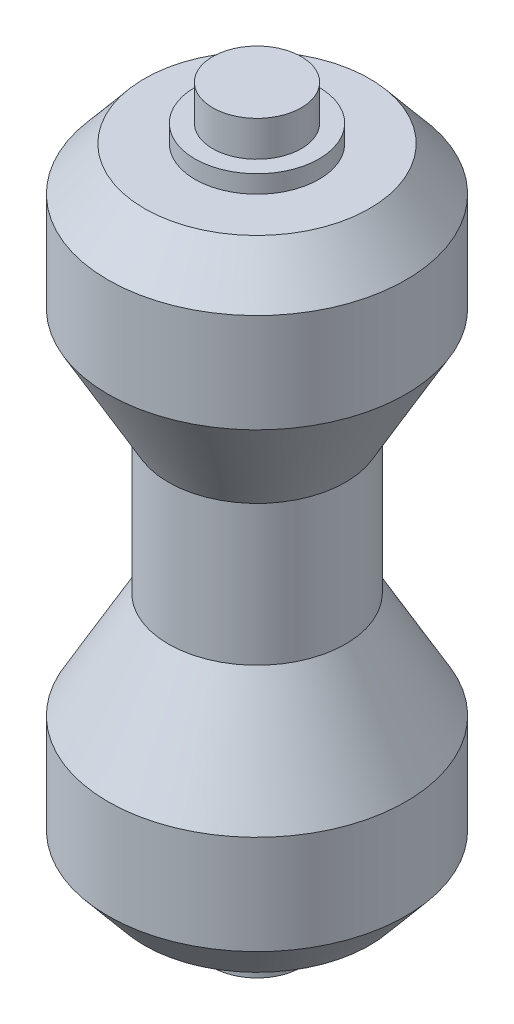
ISO-10303-21;
HEADER;
FILE_DESCRIPTION(('STEP AP214'),'2;1');
FILE_NAME('part.step','',(''),(''),'','','');
FILE_SCHEMA(('AUTOMOTIVE_DESIGN { 1 0 10303 214 1 1 1 1 }'));
ENDSEC;
DATA;
#1=APPLICATION_CONTEXT('core data for automotive mechanical design processes');
#2=APPLICATION_PROTOCOL_DEFINITION('international standard','automotive_design',2000,#1);
#3=PRODUCT_CONTEXT('',#1,'mechanical');
#4=PRODUCT('Part','Part','',(#3));
#5=PRODUCT_RELATED_PRODUCT_CATEGORY('part','',(#4));
#6=PRODUCT_DEFINITION_FORMATION('','',#4);
#7=PRODUCT_DEFINITION_CONTEXT('part definition',#1,'design');
#8=PRODUCT_DEFINITION('design','',#6,#7);
#9=PRODUCT_DEFINITION_SHAPE('','',#8);
#10=(LENGTH_UNIT() NAMED_UNIT(*) SI_UNIT(.MILLI.,.METRE.));
#11=(NAMED_UNIT(*) PLANE_ANGLE_UNIT() SI_UNIT($,.RADIAN.));
#12=(NAMED_UNIT(*) SI_UNIT($,.STERADIAN.) SOLID_ANGLE_UNIT());
#13=UNCERTAINTY_MEASURE_WITH_UNIT(LENGTH_MEASURE(1.E-05),#10,'distance_accuracy_value','');
#14=(GEOMETRIC_REPRESENTATION_CONTEXT(3) GLOBAL_UNCERTAINTY_ASSIGNED_CONTEXT((#13)) GLOBAL_UNIT_ASSIGNED_CONTEXT((#10,
#11,#12)) REPRESENTATION_CONTEXT('',''));
#15=CARTESIAN_POINT('',(0.,0.,0.));
#16=DIRECTION('',(0.,0.,1.));
#17=DIRECTION('',(1.,0.,0.));
#18=AXIS2_PLACEMENT_3D('',#15,#16,#17);
#19=CARTESIAN_POINT('',(0.,34.5729996705078,0.));
#20=DIRECTION('',(0.,-1.,0.));
#21=DIRECTION('',(0.,0.,-1.));
#22=AXIS2_PLACEMENT_3D('',#19,#20,#21);
#23=PLANE('',#22);
#24=CARTESIAN_POINT('',(0.,34.5729996705078,0.));
#25=DIRECTION('',(0.,1.,0.));
#26=DIRECTION('',(0.,0.,1.));
#27=AXIS2_PLACEMENT_3D('',#24,#25,#26);
#28=CIRCLE('',#27,2.5);
#29=CARTESIAN_POINT('',(0.,34.5729996705078,2.5));
#30=VERTEX_POINT('',#29);
#31=EDGE_CURVE('E10',#30,#30,#28,.T.);
#32=ORIENTED_EDGE('',*,*,#31,.T.);
#33=EDGE_LOOP('',(#32));
#34=FACE_BOUND('',#33,.T.);
#35=ADVANCED_FACE('F31',(#34),#23,.F.);
#36=CARTESIAN_POINT('',(0.,34.5729996705078,0.));
#37=DIRECTION('',(0.,1.,0.));
#38=DIRECTION('',(0.,0.,1.));
#39=AXIS2_PLACEMENT_3D('',#36,#37,#38);
#40=CYLINDRICAL_SURFACE('',#39,2.5);
#41=ORIENTED_EDGE('',*,*,#31,.F.);
#42=EDGE_LOOP('',(#41));
#43=FACE_BOUND('',#42,.T.);
#44=CARTESIAN_POINT('',(0.,32.5729996705078,0.));
#45=DIRECTION('',(0.,1.,0.));
#46=DIRECTION('',(0.,0.,1.));
#47=AXIS2_PLACEMENT_3D('',#44,#45,#46);
#48=CIRCLE('',#47,2.5);
#49=CARTESIAN_POINT('',(0.,32.5729996705078,2.5));
#50=VERTEX_POINT('',#49);
#51=EDGE_CURVE('E37',#50,#50,#48,.T.);
#52=ORIENTED_EDGE('',*,*,#51,.T.);
#53=EDGE_LOOP('',(#52));
#54=FACE_BOUND('',#53,.T.);
#55=ADVANCED_FACE('F101',(#43,#54),#40,.T.);
#56=CARTESIAN_POINT('',(2.5,32.5729996705078,0.));
#57=DIRECTION('',(0.,-1.,0.));
#58=DIRECTION('',(0.,0.,-1.));
#59=AXIS2_PLACEMENT_3D('',#56,#57,#58);
#60=PLANE('',#59);
#61=ORIENTED_EDGE('',*,*,#51,.F.);
#62=EDGE_LOOP('',(#61));
#63=FACE_BOUND('',#62,.T.);
#64=CARTESIAN_POINT('',(0.,32.5729996705078,0.));
#65=DIRECTION('',(0.,1.,0.));
#66=DIRECTION('',(0.,0.,1.));
#67=AXIS2_PLACEMENT_3D('',#64,#65,#66);
#68=CIRCLE('',#67,3.5);
#69=CARTESIAN_POINT('',(0.,32.5729996705078,3.5));
#70=VERTEX_POINT('',#69);
#71=EDGE_CURVE('E41',#70,#70,#68,.T.);
#72=ORIENTED_EDGE('',*,*,#71,.T.);
#73=EDGE_LOOP('',(#72));
#74=FACE_BOUND('',#73,.T.);
#75=ADVANCED_FACE('F105',(#63,#74),#60,.F.);
#76=CARTESIAN_POINT('',(0.,34.5729996705078,0.));
#77=DIRECTION('',(0.,1.,0.));
#78=DIRECTION('',(0.,0.,1.));
#79=AXIS2_PLACEMENT_3D('',#76,#77,#78);
#80=CYLINDRICAL_SURFACE('',#79,3.5);
#81=ORIENTED_EDGE('',*,*,#71,.F.);
#82=EDGE_LOOP('',(#81));
#83=FACE_BOUND('',#82,.T.);
#84=CARTESIAN_POINT('',(0.,31.5729996705078,0.));
#85=DIRECTION('',(0.,1.,0.));
#86=DIRECTION('',(0.,0.,1.));
#87=AXIS2_PLACEMENT_3D('',#84,#85,#86);
#88=CIRCLE('',#87,3.5);
#89=CARTESIAN_POINT('',(0.,31.5729996705078,3.5));
#90=VERTEX_POINT('',#89);
#91=EDGE_CURVE('E45',#90,#90,#88,.T.);
#92=ORIENTED_EDGE('',*,*,#91,.T.);
#93=EDGE_LOOP('',(#92));
#94=FACE_BOUND('',#93,.T.);
#95=ADVANCED_FACE('F110',(#83,#94),#80,.T.);
#96=CARTESIAN_POINT('',(3.5,31.5729996705078,0.));
#97=DIRECTION('',(0.,-1.,0.));
#98=DIRECTION('',(0.,0.,-1.));
#99=AXIS2_PLACEMENT_3D('',#96,#97,#98);
#100=PLANE('',#99);
#101=ORIENTED_EDGE('',*,*,#91,.F.);
#102=EDGE_LOOP('',(#101));
#103=FACE_BOUND('',#102,.T.);
#104=CARTESIAN_POINT('',(0.,31.5729996705078,0.));
#105=DIRECTION('',(0.,1.,0.));
#106=DIRECTION('',(0.,0.,1.));
#107=AXIS2_PLACEMENT_3D('',#104,#105,#106);
#108=CIRCLE('',#107,6.35094369584215);
#109=CARTESIAN_POINT('',(0.,31.5729996705078,6.35094369584215));
#110=VERTEX_POINT('',#109);
#111=EDGE_CURVE('E50',#110,#110,#108,.T.);
#112=ORIENTED_EDGE('',*,*,#111,.T.);
#113=EDGE_LOOP('',(#112));
#114=FACE_BOUND('',#113,.T.);
#115=ADVANCED_FACE('F116',(#103,#114),#100,.F.);
#116=CARTESIAN_POINT('',(0.,29.111258282024,0.));
#117=DIRECTION('',(0.,-1.,0.));
#118=DIRECTION('',(0.,0.,-1.));
#119=AXIS2_PLACEMENT_3D('',#116,#117,#118);
#120=CONICAL_SURFACE('',#119,8.40239485291198,0.694738276196704);
#121=ORIENTED_EDGE('',*,*,#111,.F.);
#122=EDGE_LOOP('',(#121));
#123=FACE_BOUND('',#122,.T.);
#124=CARTESIAN_POINT('',(0.,29.111258282024,0.));
#125=DIRECTION('',(0.,1.,0.));
#126=DIRECTION('',(0.,0.,1.));
#127=AXIS2_PLACEMENT_3D('',#124,#125,#126);
#128=CIRCLE('',#127,8.40239485291198);
#129=CARTESIAN_POINT('',(0.,29.111258282024,8.40239485291198));
#130=VERTEX_POINT('',#129);
#131=EDGE_CURVE('E53',#130,#130,#128,.T.);
#132=ORIENTED_EDGE('',*,*,#131,.T.);
#133=EDGE_LOOP('',(#132));
#134=FACE_BOUND('',#133,.T.);
#135=ADVANCED_FACE('F120',(#123,#134),#120,.T.);
#136=CARTESIAN_POINT('',(0.,34.5729996705078,0.));
#137=DIRECTION('',(0.,1.,0.));
#138=DIRECTION('',(0.,0.,1.));
#139=AXIS2_PLACEMENT_3D('',#136,#137,#138);
#140=CYLINDRICAL_SURFACE('',#139,8.40239485291198);
#141=ORIENTED_EDGE('',*,*,#131,.F.);
#142=EDGE_LOOP('',(#141));
#143=FACE_BOUND('',#142,.T.);
#144=CARTESIAN_POINT('',(0.,23.525945839723,0.));
#145=DIRECTION('',(0.,1.,0.));
#146=DIRECTION('',(0.,0.,1.));
#147=AXIS2_PLACEMENT_3D('',#144,#145,#146);
#148=CIRCLE('',#147,8.40239485291198);
#149=CARTESIAN_POINT('',(0.,23.525945839723,8.40239485291198));
#150=VERTEX_POINT('',#149);
#151=EDGE_CURVE('E56',#150,#150,#148,.T.);
#152=ORIENTED_EDGE('',*,*,#151,.T.);
#153=EDGE_LOOP('',(#152));
#154=FACE_BOUND('',#153,.T.);
#155=ADVANCED_FACE('F124',(#143,#154),#140,.T.);
#156=CARTESIAN_POINT('',(0.,17.525945839723,0.));
#157=DIRECTION('',(0.,1.,0.));
#158=DIRECTION('',(0.,0.,1.));
#159=AXIS2_PLACEMENT_3D('',#156,#157,#158);
#160=CONICAL_SURFACE('',#159,5.,0.515851081836486);
#161=ORIENTED_EDGE('',*,*,#151,.F.);
#162=EDGE_LOOP('',(#161));
#163=FACE_BOUND('',#162,.T.);
#164=CARTESIAN_POINT('',(0.,17.525945839723,0.));
#165=DIRECTION('',(0.,1.,0.));
#166=DIRECTION('',(0.,0.,1.));
#167=AXIS2_PLACEMENT_3D('',#164,#165,#166);
#168=CIRCLE('',#167,5.);
#169=CARTESIAN_POINT('',(0.,17.525945839723,5.));
#170=VERTEX_POINT('',#169);
#171=EDGE_CURVE('E59',#170,#170,#168,.T.);
#172=ORIENTED_EDGE('',*,*,#171,.T.);
#173=EDGE_LOOP('',(#172));
#174=FACE_BOUND('',#173,.T.);
#175=ADVANCED_FACE('F128',(#163,#174),#160,.T.);
#176=CARTESIAN_POINT('',(0.,34.5729996705078,0.));
#177=DIRECTION('',(0.,1.,0.));
#178=DIRECTION('',(0.,0.,1.));
#179=AXIS2_PLACEMENT_3D('',#176,#177,#178);
#180=CYLINDRICAL_SURFACE('',#179,5.);
#181=ORIENTED_EDGE('',*,*,#171,.F.);
#182=EDGE_LOOP('',(#181));
#183=FACE_BOUND('',#182,.T.);
#184=CARTESIAN_POINT('',(0.,9.62005350129262,0.));
#185=DIRECTION('',(0.,1.,0.));
#186=DIRECTION('',(0.,0.,1.));
#187=AXIS2_PLACEMENT_3D('',#184,#185,#186);
#188=CIRCLE('',#187,5.);
#189=CARTESIAN_POINT('',(0.,9.62005350129262,5.));
#190=VERTEX_POINT('',#189);
#191=EDGE_CURVE('E83',#190,#190,#188,.T.);
#192=ORIENTED_EDGE('',*,*,#191,.T.);
#193=EDGE_LOOP('',(#192));
#194=FACE_BOUND('',#193,.T.);
#195=ADVANCED_FACE('F87',(#183,#194),#180,.T.);
#196=CARTESIAN_POINT('',(0.,-7.42700032949218,0.));
#197=DIRECTION('',(0.,1.,0.));
#198=DIRECTION('',(0.,0.,-1.));
#199=AXIS2_PLACEMENT_3D('',#196,#197,#198);
#200=PLANE('',#199);
#201=CARTESIAN_POINT('',(0.,-7.42700032949218,0.));
#202=DIRECTION('',(0.,1.,0.));
#203=DIRECTION('',(0.,0.,1.));
#204=AXIS2_PLACEMENT_3D('',#201,#202,#203);
#205=CIRCLE('',#204,2.5);
#206=CARTESIAN_POINT('',(0.,-7.42700032949218,2.5));
#207=VERTEX_POINT('',#206);
#208=EDGE_CURVE('E62',#207,#207,#205,.T.);
#209=ORIENTED_EDGE('',*,*,#208,.F.);
#210=EDGE_LOOP('',(#209));
#211=FACE_BOUND('',#210,.T.);
#212=ADVANCED_FACE('F135',(#211),#200,.F.);
#213=CARTESIAN_POINT('',(0.,-7.42700032949218,0.));
#214=DIRECTION('',(0.,-1.,0.));
#215=DIRECTION('',(0.,0.,1.));
#216=AXIS2_PLACEMENT_3D('',#213,#214,#215);
#217=CYLINDRICAL_SURFACE('',#216,2.5);
#218=ORIENTED_EDGE('',*,*,#208,.T.);
#219=EDGE_LOOP('',(#218));
#220=FACE_BOUND('',#219,.T.);
#221=CARTESIAN_POINT('',(0.,-5.42700032949218,0.));
#222=DIRECTION('',(0.,1.,0.));
#223=DIRECTION('',(0.,0.,1.));
#224=AXIS2_PLACEMENT_3D('',#221,#222,#223);
#225=CIRCLE('',#224,2.5);
#226=CARTESIAN_POINT('',(0.,-5.42700032949218,2.5));
#227=VERTEX_POINT('',#226);
#228=EDGE_CURVE('E65',#227,#227,#225,.T.);
#229=ORIENTED_EDGE('',*,*,#228,.F.);
#230=EDGE_LOOP('',(#229));
#231=FACE_BOUND('',#230,.T.);
#232=ADVANCED_FACE('F139',(#220,#231),#217,.T.);
#233=CARTESIAN_POINT('',(2.5,-5.42700032949218,0.));
#234=DIRECTION('',(0.,1.,0.));
#235=DIRECTION('',(0.,0.,-1.));
#236=AXIS2_PLACEMENT_3D('',#233,#234,#235);
#237=PLANE('',#236);
#238=ORIENTED_EDGE('',*,*,#228,.T.);
#239=EDGE_LOOP('',(#238));
#240=FACE_BOUND('',#239,.T.);
#241=CARTESIAN_POINT('',(0.,-5.42700032949218,0.));
#242=DIRECTION('',(0.,1.,0.));
#243=DIRECTION('',(0.,0.,1.));
#244=AXIS2_PLACEMENT_3D('',#241,#242,#243);
#245=CIRCLE('',#244,3.5);
#246=CARTESIAN_POINT('',(0.,-5.42700032949218,3.5));
#247=VERTEX_POINT('',#246);
#248=EDGE_CURVE('E68',#247,#247,#245,.T.);
#249=ORIENTED_EDGE('',*,*,#248,.F.);
#250=EDGE_LOOP('',(#249));
#251=FACE_BOUND('',#250,.T.);
#252=ADVANCED_FACE('F143',(#240,#251),#237,.F.);
#253=CARTESIAN_POINT('',(0.,-7.42700032949218,0.));
#254=DIRECTION('',(0.,-1.,0.));
#255=DIRECTION('',(0.,0.,1.));
#256=AXIS2_PLACEMENT_3D('',#253,#254,#255);
#257=CYLINDRICAL_SURFACE('',#256,3.5);
#258=ORIENTED_EDGE('',*,*,#248,.T.);
#259=EDGE_LOOP('',(#258));
#260=FACE_BOUND('',#259,.T.);
#261=CARTESIAN_POINT('',(0.,-4.42700032949218,0.));
#262=DIRECTION('',(0.,1.,0.));
#263=DIRECTION('',(0.,0.,1.));
#264=AXIS2_PLACEMENT_3D('',#261,#262,#263);
#265=CIRCLE('',#264,3.5);
#266=CARTESIAN_POINT('',(0.,-4.42700032949218,3.5));
#267=VERTEX_POINT('',#266);
#268=EDGE_CURVE('E71',#267,#267,#265,.T.);
#269=ORIENTED_EDGE('',*,*,#268,.F.);
#270=EDGE_LOOP('',(#269));
#271=FACE_BOUND('',#270,.T.);
#272=ADVANCED_FACE('F147',(#260,#271),#257,.T.);
#273=CARTESIAN_POINT('',(3.5,-4.42700032949218,0.));
#274=DIRECTION('',(0.,1.,0.));
#275=DIRECTION('',(0.,0.,-1.));
#276=AXIS2_PLACEMENT_3D('',#273,#274,#275);
#277=PLANE('',#276);
#278=ORIENTED_EDGE('',*,*,#268,.T.);
#279=EDGE_LOOP('',(#278));
#280=FACE_BOUND('',#279,.T.);
#281=CARTESIAN_POINT('',(0.,-4.42700032949218,0.));
#282=DIRECTION('',(0.,1.,0.));
#283=DIRECTION('',(0.,0.,1.));
#284=AXIS2_PLACEMENT_3D('',#281,#282,#283);
#285=CIRCLE('',#284,6.35094369584215);
#286=CARTESIAN_POINT('',(0.,-4.42700032949218,6.35094369584215));
#287=VERTEX_POINT('',#286);
#288=EDGE_CURVE('E74',#287,#287,#285,.T.);
#289=ORIENTED_EDGE('',*,*,#288,.F.);
#290=EDGE_LOOP('',(#289));
#291=FACE_BOUND('',#290,.T.);
#292=ADVANCED_FACE('F151',(#280,#291),#277,.F.);
#293=CARTESIAN_POINT('',(0.,-1.96525894100838,0.));
#294=DIRECTION('',(0.,1.,0.));
#295=DIRECTION('',(0.,0.,-1.));
#296=AXIS2_PLACEMENT_3D('',#293,#294,#295);
#297=CONICAL_SURFACE('',#296,8.40239485291198,0.694738276196704);
#298=ORIENTED_EDGE('',*,*,#288,.T.);
#299=EDGE_LOOP('',(#298));
#300=FACE_BOUND('',#299,.T.);
#301=CARTESIAN_POINT('',(0.,-1.96525894100838,0.));
#302=DIRECTION('',(0.,1.,0.));
#303=DIRECTION('',(0.,0.,1.));
#304=AXIS2_PLACEMENT_3D('',#301,#302,#303);
#305=CIRCLE('',#304,8.40239485291198);
#306=CARTESIAN_POINT('',(0.,-1.96525894100838,8.40239485291198));
#307=VERTEX_POINT('',#306);
#308=EDGE_CURVE('E77',#307,#307,#305,.T.);
#309=ORIENTED_EDGE('',*,*,#308,.F.);
#310=EDGE_LOOP('',(#309));
#311=FACE_BOUND('',#310,.T.);
#312=ADVANCED_FACE('F97',(#300,#311),#297,.T.);
#313=CARTESIAN_POINT('',(0.,-7.42700032949218,0.));
#314=DIRECTION('',(0.,-1.,0.));
#315=DIRECTION('',(0.,0.,1.));
#316=AXIS2_PLACEMENT_3D('',#313,#314,#315);
#317=CYLINDRICAL_SURFACE('',#316,8.40239485291198);
#318=ORIENTED_EDGE('',*,*,#308,.T.);
#319=EDGE_LOOP('',(#318));
#320=FACE_BOUND('',#319,.T.);
#321=CARTESIAN_POINT('',(0.,3.62005350129262,0.));
#322=DIRECTION('',(0.,1.,0.));
#323=DIRECTION('',(0.,0.,1.));
#324=AXIS2_PLACEMENT_3D('',#321,#322,#323);
#325=CIRCLE('',#324,8.40239485291198);
#326=CARTESIAN_POINT('',(0.,3.62005350129262,8.40239485291198));
#327=VERTEX_POINT('',#326);
#328=EDGE_CURVE('E80',#327,#327,#325,.T.);
#329=ORIENTED_EDGE('',*,*,#328,.F.);
#330=EDGE_LOOP('',(#329));
#331=FACE_BOUND('',#330,.T.);
#332=ADVANCED_FACE('F91',(#320,#331),#317,.T.);
#333=CARTESIAN_POINT('',(0.,9.62005350129262,0.));
#334=DIRECTION('',(0.,-1.,0.));
#335=DIRECTION('',(0.,0.,1.));
#336=AXIS2_PLACEMENT_3D('',#333,#334,#335);
#337=CONICAL_SURFACE('',#336,5.,0.515851081836486);
#338=ORIENTED_EDGE('',*,*,#328,.T.);
#339=EDGE_LOOP('',(#338));
#340=FACE_BOUND('',#339,.T.);
#341=ORIENTED_EDGE('',*,*,#191,.F.);
#342=EDGE_LOOP('',(#341));
#343=FACE_BOUND('',#342,.T.);
#344=ADVANCED_FACE('F89',(#340,#343),#337,.T.);
#345=CLOSED_SHELL('',(#35,#55,#75,#95,#115,#135,#155,#175,#195,#212,#232,#252,#272,#292,#312,
#332,#344));
#346=MANIFOLD_SOLID_BREP('B2',#345);
#347=ADVANCED_BREP_SHAPE_REPRESENTATION('',(#18,#346),#14);
#348=SHAPE_DEFINITION_REPRESENTATION(#9,#347);
ENDSEC;
END-ISO-10303-21;
